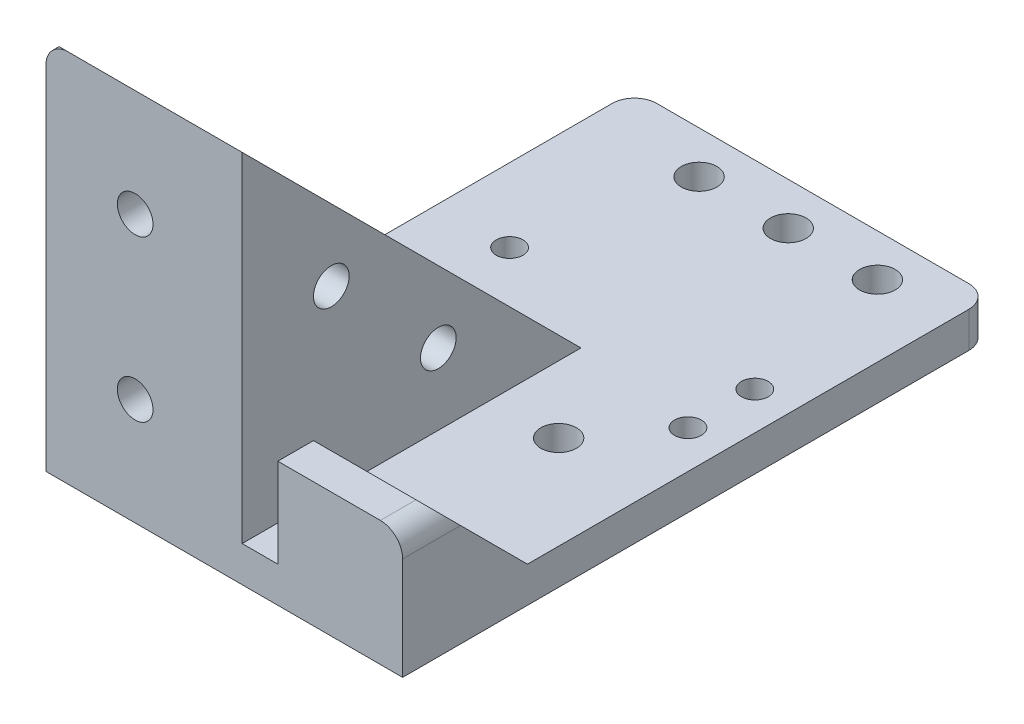
ISO-10303-21;
HEADER;
FILE_DESCRIPTION(('STEP AP214'),'2;1');
FILE_NAME('part.step','',(''),(''),'','','');
FILE_SCHEMA(('AUTOMOTIVE_DESIGN { 1 0 10303 214 1 1 1 1 }'));
ENDSEC;
DATA;
#1=APPLICATION_CONTEXT('core data for automotive mechanical design processes');
#2=APPLICATION_PROTOCOL_DEFINITION('international standard','automotive_design',2000,#1);
#3=PRODUCT_CONTEXT('',#1,'mechanical');
#4=PRODUCT('Part','Part','',(#3));
#5=PRODUCT_RELATED_PRODUCT_CATEGORY('part','',(#4));
#6=PRODUCT_DEFINITION_FORMATION('','',#4);
#7=PRODUCT_DEFINITION_CONTEXT('part definition',#1,'design');
#8=PRODUCT_DEFINITION('design','',#6,#7);
#9=PRODUCT_DEFINITION_SHAPE('','',#8);
#10=(LENGTH_UNIT() NAMED_UNIT(*) SI_UNIT(.MILLI.,.METRE.));
#11=(NAMED_UNIT(*) PLANE_ANGLE_UNIT() SI_UNIT($,.RADIAN.));
#12=(NAMED_UNIT(*) SI_UNIT($,.STERADIAN.) SOLID_ANGLE_UNIT());
#13=UNCERTAINTY_MEASURE_WITH_UNIT(LENGTH_MEASURE(1.E-05),#10,'distance_accuracy_value','');
#14=(GEOMETRIC_REPRESENTATION_CONTEXT(3) GLOBAL_UNCERTAINTY_ASSIGNED_CONTEXT((#13)) GLOBAL_UNIT_ASSIGNED_CONTEXT((#10,
#11,#12)) REPRESENTATION_CONTEXT('',''));
#15=CARTESIAN_POINT('',(0.,0.,0.));
#16=DIRECTION('',(0.,0.,1.));
#17=DIRECTION('',(1.,0.,0.));
#18=AXIS2_PLACEMENT_3D('',#15,#16,#17);
#19=CARTESIAN_POINT('',(-20.,4.,0.));
#20=DIRECTION('',(0.,0.,-1.));
#21=DIRECTION('',(-1.,0.,0.));
#22=AXIS2_PLACEMENT_3D('',#19,#20,#21);
#23=PLANE('',#22);
#24=CARTESIAN_POINT('',(-10.,12.,0.));
#25=DIRECTION('',(0.,0.,-1.));
#26=DIRECTION('',(-1.,0.,0.));
#27=AXIS2_PLACEMENT_3D('',#24,#25,#26);
#28=CIRCLE('',#27,2.);
#29=CARTESIAN_POINT('',(-12.,12.,0.));
#30=VERTEX_POINT('',#29);
#31=EDGE_CURVE('E357',#30,#30,#28,.T.);
#32=ORIENTED_EDGE('',*,*,#31,.T.);
#33=EDGE_LOOP('',(#32));
#34=FACE_BOUND('',#33,.T.);
#35=CARTESIAN_POINT('',(-10.,30.,0.));
#36=DIRECTION('',(0.,0.,-1.));
#37=DIRECTION('',(-1.,0.,0.));
#38=AXIS2_PLACEMENT_3D('',#35,#36,#37);
#39=CIRCLE('',#38,2.);
#40=CARTESIAN_POINT('',(-12.,30.,0.));
#41=VERTEX_POINT('',#40);
#42=EDGE_CURVE('E363',#41,#41,#39,.T.);
#43=ORIENTED_EDGE('',*,*,#42,.T.);
#44=EDGE_LOOP('',(#43));
#45=FACE_BOUND('',#44,.T.);
#46=DIRECTION('',(0.,-1.,0.));
#47=VECTOR('',#46,1.);
#48=CARTESIAN_POINT('',(20.,4.,0.));
#49=LINE('',#48,#47);
#50=CARTESIAN_POINT('',(20.,11.5,0.));
#51=VERTEX_POINT('',#50);
#52=CARTESIAN_POINT('',(20.,0.,0.));
#53=VERTEX_POINT('',#52);
#54=EDGE_CURVE('E177',#51,#53,#49,.T.);
#55=ORIENTED_EDGE('',*,*,#54,.F.);
#56=CARTESIAN_POINT('',(17.5,11.5,0.));
#57=DIRECTION('',(0.,0.,-1.));
#58=DIRECTION('',(-1.,0.,0.));
#59=AXIS2_PLACEMENT_3D('',#56,#57,#58);
#60=CIRCLE('',#59,2.5);
#61=CARTESIAN_POINT('',(17.5,14.,0.));
#62=VERTEX_POINT('',#61);
#63=EDGE_CURVE('E55',#51,#62,#60,.F.);
#64=ORIENTED_EDGE('',*,*,#63,.T.);
#65=DIRECTION('',(-1.,0.,0.));
#66=VECTOR('',#65,1.);
#67=CARTESIAN_POINT('',(6.,14.,0.));
#68=LINE('',#67,#66);
#69=CARTESIAN_POINT('',(6.,14.,0.));
#70=VERTEX_POINT('',#69);
#71=EDGE_CURVE('E192',#62,#70,#68,.T.);
#72=ORIENTED_EDGE('',*,*,#71,.T.);
#73=DIRECTION('',(0.,-1.,0.));
#74=VECTOR('',#73,1.);
#75=CARTESIAN_POINT('',(6.,4.,0.));
#76=LINE('',#75,#74);
#77=CARTESIAN_POINT('',(6.,4.,0.));
#78=VERTEX_POINT('',#77);
#79=EDGE_CURVE('E342',#70,#78,#76,.T.);
#80=ORIENTED_EDGE('',*,*,#79,.T.);
#81=DIRECTION('',(1.,0.,0.));
#82=VECTOR('',#81,1.);
#83=CARTESIAN_POINT('',(-20.,4.,0.));
#84=LINE('',#83,#82);
#85=CARTESIAN_POINT('',(2.,4.,0.));
#86=VERTEX_POINT('',#85);
#87=EDGE_CURVE('E181',#86,#78,#84,.T.);
#88=ORIENTED_EDGE('',*,*,#87,.F.);
#89=DIRECTION('',(0.,-1.,0.));
#90=VECTOR('',#89,1.);
#91=CARTESIAN_POINT('',(2.,4.,0.));
#92=LINE('',#91,#90);
#93=CARTESIAN_POINT('',(2.,42.,0.));
#94=VERTEX_POINT('',#93);
#95=EDGE_CURVE('E327',#94,#86,#92,.T.);
#96=ORIENTED_EDGE('',*,*,#95,.F.);
#97=DIRECTION('',(1.,0.,0.));
#98=VECTOR('',#97,1.);
#99=CARTESIAN_POINT('',(-25.6568542494923,42.,0.));
#100=LINE('',#99,#98);
#101=CARTESIAN_POINT('',(-17.5930467247093,42.,0.));
#102=VERTEX_POINT('',#101);
#103=EDGE_CURVE('E170',#102,#94,#100,.T.);
#104=ORIENTED_EDGE('',*,*,#103,.F.);
#105=CARTESIAN_POINT('',(-17.5008468049677,39.5017007435458,0.));
#106=DIRECTION('',(0.,0.,1.));
#107=DIRECTION('',(1.,0.,0.));
#108=AXIS2_PLACEMENT_3D('',#105,#106,#107);
#109=CIRCLE('',#108,2.5);
#110=CARTESIAN_POINT('',(-20.,39.5667646180047,0.));
#111=VERTEX_POINT('',#110);
#112=EDGE_CURVE('E155',#111,#102,#109,.F.);
#113=ORIENTED_EDGE('',*,*,#112,.F.);
#114=DIRECTION('',(0.,-1.,0.));
#115=VECTOR('',#114,1.);
#116=CARTESIAN_POINT('',(-20.,4.,0.));
#117=LINE('',#116,#115);
#118=CARTESIAN_POINT('',(-20.,0.,0.));
#119=VERTEX_POINT('',#118);
#120=EDGE_CURVE('E167',#111,#119,#117,.T.);
#121=ORIENTED_EDGE('',*,*,#120,.T.);
#122=DIRECTION('',(1.,0.,0.));
#123=VECTOR('',#122,1.);
#124=CARTESIAN_POINT('',(-20.,0.,0.));
#125=LINE('',#124,#123);
#126=EDGE_CURVE('E241',#119,#53,#125,.T.);
#127=ORIENTED_EDGE('',*,*,#126,.T.);
#128=EDGE_LOOP('',(#55,#64,#72,#80,#88,#96,#104,#113,#121,#127));
#129=FACE_BOUND('',#128,.T.);
#130=ADVANCED_FACE('F33',(#34,#45,#129),#23,.F.);
#131=CARTESIAN_POINT('',(0.,0.,-4.));
#132=DIRECTION('',(0.,0.,1.));
#133=DIRECTION('',(1.,0.,0.));
#134=AXIS2_PLACEMENT_3D('',#131,#132,#133);
#135=PLANE('',#134);
#136=DIRECTION('',(0.,-1.,0.));
#137=VECTOR('',#136,1.);
#138=CARTESIAN_POINT('',(16.,14.,-4.));
#139=LINE('',#138,#137);
#140=CARTESIAN_POINT('',(16.,14.,-4.));
#141=VERTEX_POINT('',#140);
#142=CARTESIAN_POINT('',(16.,4.,-4.));
#143=VERTEX_POINT('',#142);
#144=EDGE_CURVE('E379',#141,#143,#139,.T.);
#145=ORIENTED_EDGE('',*,*,#144,.T.);
#146=DIRECTION('',(1.,0.,0.));
#147=VECTOR('',#146,1.);
#148=CARTESIAN_POINT('',(6.,4.,-4.));
#149=LINE('',#148,#147);
#150=CARTESIAN_POINT('',(6.,4.,-4.));
#151=VERTEX_POINT('',#150);
#152=EDGE_CURVE('E345',#151,#143,#149,.T.);
#153=ORIENTED_EDGE('',*,*,#152,.F.);
#154=DIRECTION('',(0.,-1.,0.));
#155=VECTOR('',#154,1.);
#156=CARTESIAN_POINT('',(6.,4.,-4.));
#157=LINE('',#156,#155);
#158=CARTESIAN_POINT('',(6.,14.,-4.));
#159=VERTEX_POINT('',#158);
#160=EDGE_CURVE('E339',#159,#151,#157,.T.);
#161=ORIENTED_EDGE('',*,*,#160,.F.);
#162=DIRECTION('',(-1.,0.,0.));
#163=VECTOR('',#162,1.);
#164=CARTESIAN_POINT('',(6.,14.,-4.));
#165=LINE('',#164,#163);
#166=EDGE_CURVE('E351',#141,#159,#165,.T.);
#167=ORIENTED_EDGE('',*,*,#166,.F.);
#168=EDGE_LOOP('',(#145,#153,#161,#167));
#169=FACE_BOUND('',#168,.T.);
#170=ADVANCED_FACE('F429',(#169),#135,.F.);
#171=CARTESIAN_POINT('',(0.,4.,0.));
#172=DIRECTION('',(0.,1.,0.));
#173=DIRECTION('',(0.,0.,1.));
#174=AXIS2_PLACEMENT_3D('',#171,#172,#173);
#175=PLANE('',#174);
#176=DIRECTION('',(-1.,0.,0.));
#177=VECTOR('',#176,1.);
#178=CARTESIAN_POINT('',(-20.,4.,-66.));
#179=LINE('',#178,#177);
#180=CARTESIAN_POINT('',(17.5,4.,-66.));
#181=VERTEX_POINT('',#180);
#182=CARTESIAN_POINT('',(-17.5,4.,-66.));
#183=VERTEX_POINT('',#182);
#184=EDGE_CURVE('E245',#181,#183,#179,.T.);
#185=ORIENTED_EDGE('',*,*,#184,.T.);
#186=CARTESIAN_POINT('',(-17.5,4.,-63.5));
#187=DIRECTION('',(0.,1.,0.));
#188=DIRECTION('',(0.,0.,1.));
#189=AXIS2_PLACEMENT_3D('',#186,#187,#188);
#190=CIRCLE('',#189,2.5);
#191=CARTESIAN_POINT('',(-20.,4.,-63.5));
#192=VERTEX_POINT('',#191);
#193=EDGE_CURVE('E224',#183,#192,#190,.T.);
#194=ORIENTED_EDGE('',*,*,#193,.T.);
#195=DIRECTION('',(0.,0.,1.));
#196=VECTOR('',#195,1.);
#197=CARTESIAN_POINT('',(-20.,4.,-66.));
#198=LINE('',#197,#196);
#199=CARTESIAN_POINT('',(-20.,4.,-38.0000000000004));
#200=VERTEX_POINT('',#199);
#201=EDGE_CURVE('E256',#192,#200,#198,.T.);
#202=ORIENTED_EDGE('',*,*,#201,.T.);
#203=DIRECTION('',(-1.,0.,0.));
#204=VECTOR('',#203,1.);
#205=CARTESIAN_POINT('',(-16.,4.,-38.0000000000004));
#206=LINE('',#205,#204);
#207=CARTESIAN_POINT('',(-16.,4.,-38.0000000000004));
#208=VERTEX_POINT('',#207);
#209=EDGE_CURVE('E380',#208,#200,#206,.T.);
#210=ORIENTED_EDGE('',*,*,#209,.F.);
#211=DIRECTION('',(0.,0.,1.));
#212=VECTOR('',#211,1.);
#213=CARTESIAN_POINT('',(-16.,4.,-38.0000000000004));
#214=LINE('',#213,#212);
#215=CARTESIAN_POINT('',(-16.,4.,-4.));
#216=VERTEX_POINT('',#215);
#217=EDGE_CURVE('E390',#208,#216,#214,.T.);
#218=ORIENTED_EDGE('',*,*,#217,.T.);
#219=DIRECTION('',(1.,0.,0.));
#220=VECTOR('',#219,1.);
#221=CARTESIAN_POINT('',(-20.,4.,-4.));
#222=LINE('',#221,#220);
#223=CARTESIAN_POINT('',(-2.,4.,-4.));
#224=VERTEX_POINT('',#223);
#225=EDGE_CURVE('E196',#216,#224,#222,.T.);
#226=ORIENTED_EDGE('',*,*,#225,.T.);
#227=DIRECTION('',(0.,0.,-1.));
#228=VECTOR('',#227,1.);
#229=CARTESIAN_POINT('',(-2.,4.,-38.0000000000004));
#230=LINE('',#229,#228);
#231=CARTESIAN_POINT('',(-2.,4.,-38.0000000000004));
#232=VERTEX_POINT('',#231);
#233=EDGE_CURVE('E209',#224,#232,#230,.T.);
#234=ORIENTED_EDGE('',*,*,#233,.T.);
#235=DIRECTION('',(1.,0.,0.));
#236=VECTOR('',#235,1.);
#237=CARTESIAN_POINT('',(-2.,4.,-38.0000000000004));
#238=LINE('',#237,#236);
#239=CARTESIAN_POINT('',(2.,4.,-38.0000000000004));
#240=VERTEX_POINT('',#239);
#241=EDGE_CURVE('E208',#232,#240,#238,.T.);
#242=ORIENTED_EDGE('',*,*,#241,.T.);
#243=DIRECTION('',(0.,0.,-1.));
#244=VECTOR('',#243,1.);
#245=CARTESIAN_POINT('',(2.,4.,-38.0000000000004));
#246=LINE('',#245,#244);
#247=EDGE_CURVE('E332',#86,#240,#246,.T.);
#248=ORIENTED_EDGE('',*,*,#247,.F.);
#249=ORIENTED_EDGE('',*,*,#87,.T.);
#250=DIRECTION('',(0.,0.,1.));
#251=VECTOR('',#250,1.);
#252=CARTESIAN_POINT('',(6.,4.,-4.));
#253=LINE('',#252,#251);
#254=EDGE_CURVE('E202',#151,#78,#253,.T.);
#255=ORIENTED_EDGE('',*,*,#254,.F.);
#256=ORIENTED_EDGE('',*,*,#152,.T.);
#257=DIRECTION('',(0.,0.,-1.));
#258=VECTOR('',#257,1.);
#259=CARTESIAN_POINT('',(16.,4.,-4.));
#260=LINE('',#259,#258);
#261=CARTESIAN_POINT('',(16.,4.,-14.));
#262=VERTEX_POINT('',#261);
#263=EDGE_CURVE('E383',#143,#262,#260,.T.);
#264=ORIENTED_EDGE('',*,*,#263,.T.);
#265=DIRECTION('',(1.,0.,0.));
#266=VECTOR('',#265,1.);
#267=CARTESIAN_POINT('',(16.,4.,-14.));
#268=LINE('',#267,#266);
#269=CARTESIAN_POINT('',(20.,4.,-14.));
#270=VERTEX_POINT('',#269);
#271=EDGE_CURVE('E374',#262,#270,#268,.T.);
#272=ORIENTED_EDGE('',*,*,#271,.T.);
#273=DIRECTION('',(0.,0.,-1.));
#274=VECTOR('',#273,1.);
#275=CARTESIAN_POINT('',(20.,4.,-6.));
#276=LINE('',#275,#274);
#277=CARTESIAN_POINT('',(20.,4.,-63.5));
#278=VERTEX_POINT('',#277);
#279=EDGE_CURVE('E243',#270,#278,#276,.T.);
#280=ORIENTED_EDGE('',*,*,#279,.T.);
#281=CARTESIAN_POINT('',(17.5,4.,-63.5));
#282=DIRECTION('',(0.,1.,0.));
#283=DIRECTION('',(0.,0.,1.));
#284=AXIS2_PLACEMENT_3D('',#281,#282,#283);
#285=CIRCLE('',#284,2.5);
#286=EDGE_CURVE('E222',#278,#181,#285,.T.);
#287=ORIENTED_EDGE('',*,*,#286,.T.);
#288=EDGE_LOOP('',(#185,#194,#202,#210,#218,#226,#234,#242,#248,#249,#255,#256,#264,#272,#280,#287));
#289=FACE_BOUND('',#288,.T.);
#290=CARTESIAN_POINT('',(-11.7538718197397,4.,-36.25));
#291=DIRECTION('',(0.,1.,0.));
#292=DIRECTION('',(0.,0.,1.));
#293=AXIS2_PLACEMENT_3D('',#290,#291,#292);
#294=CIRCLE('',#293,1.5);
#295=CARTESIAN_POINT('',(-11.7538718197397,4.,-34.75));
#296=VERTEX_POINT('',#295);
#297=EDGE_CURVE('E266',#296,#296,#294,.T.);
#298=ORIENTED_EDGE('',*,*,#297,.F.);
#299=EDGE_LOOP('',(#298));
#300=FACE_BOUND('',#299,.T.);
#301=CARTESIAN_POINT('',(-11.7538718197397,4.,-43.75));
#302=DIRECTION('',(0.,1.,0.));
#303=DIRECTION('',(0.,0.,1.));
#304=AXIS2_PLACEMENT_3D('',#301,#302,#303);
#305=CIRCLE('',#304,1.5);
#306=CARTESIAN_POINT('',(-11.7538718197397,4.,-42.25));
#307=VERTEX_POINT('',#306);
#308=EDGE_CURVE('E272',#307,#307,#305,.T.);
#309=ORIENTED_EDGE('',*,*,#308,.F.);
#310=EDGE_LOOP('',(#309));
#311=FACE_BOUND('',#310,.T.);
#312=CARTESIAN_POINT('',(1.99612818026033,4.,-61.25));
#313=DIRECTION('',(0.,1.,0.));
#314=DIRECTION('',(0.,0.,1.));
#315=AXIS2_PLACEMENT_3D('',#312,#313,#314);
#316=CIRCLE('',#315,2.);
#317=CARTESIAN_POINT('',(1.99612818026033,4.,-59.25));
#318=VERTEX_POINT('',#317);
#319=EDGE_CURVE('E298',#318,#318,#316,.T.);
#320=ORIENTED_EDGE('',*,*,#319,.F.);
#321=EDGE_LOOP('',(#320));
#322=FACE_BOUND('',#321,.T.);
#323=CARTESIAN_POINT('',(11.9961281802603,4.,-61.25));
#324=DIRECTION('',(0.,1.,0.));
#325=DIRECTION('',(0.,0.,1.));
#326=AXIS2_PLACEMENT_3D('',#323,#324,#325);
#327=CIRCLE('',#326,2.);
#328=CARTESIAN_POINT('',(11.9961281802603,4.,-59.25));
#329=VERTEX_POINT('',#328);
#330=EDGE_CURVE('E292',#329,#329,#327,.T.);
#331=ORIENTED_EDGE('',*,*,#330,.F.);
#332=EDGE_LOOP('',(#331));
#333=FACE_BOUND('',#332,.T.);
#334=CARTESIAN_POINT('',(-5.50387181973967,4.,-7.99999999999999));
#335=DIRECTION('',(0.,1.,0.));
#336=DIRECTION('',(0.,0.,1.));
#337=AXIS2_PLACEMENT_3D('',#334,#335,#336);
#338=CIRCLE('',#337,2.);
#339=CARTESIAN_POINT('',(-5.50387181973967,4.,-5.99999999999999));
#340=VERTEX_POINT('',#339);
#341=EDGE_CURVE('E286',#340,#340,#338,.T.);
#342=ORIENTED_EDGE('',*,*,#341,.F.);
#343=EDGE_LOOP('',(#342));
#344=FACE_BOUND('',#343,.T.);
#345=CARTESIAN_POINT('',(-5.50387181973967,4.,-28.));
#346=DIRECTION('',(0.,1.,0.));
#347=DIRECTION('',(0.,0.,1.));
#348=AXIS2_PLACEMENT_3D('',#345,#346,#347);
#349=CIRCLE('',#348,2.);
#350=CARTESIAN_POINT('',(-5.50387181973967,4.,-26.));
#351=VERTEX_POINT('',#350);
#352=EDGE_CURVE('E279',#351,#351,#349,.T.);
#353=ORIENTED_EDGE('',*,*,#352,.F.);
#354=EDGE_LOOP('',(#353));
#355=FACE_BOUND('',#354,.T.);
#356=CARTESIAN_POINT('',(9.49612818026033,4.,-28.));
#357=DIRECTION('',(0.,1.,0.));
#358=DIRECTION('',(0.,0.,1.));
#359=AXIS2_PLACEMENT_3D('',#356,#357,#358);
#360=CIRCLE('',#359,2.);
#361=CARTESIAN_POINT('',(9.49612818026033,4.,-26.));
#362=VERTEX_POINT('',#361);
#363=EDGE_CURVE('E320',#362,#362,#360,.T.);
#364=ORIENTED_EDGE('',*,*,#363,.F.);
#365=EDGE_LOOP('',(#364));
#366=FACE_BOUND('',#365,.T.);
#367=CARTESIAN_POINT('',(9.49612818026033,4.,-7.99999999999999));
#368=DIRECTION('',(0.,1.,0.));
#369=DIRECTION('',(0.,0.,1.));
#370=AXIS2_PLACEMENT_3D('',#367,#368,#369);
#371=CIRCLE('',#370,2.);
#372=CARTESIAN_POINT('',(9.49612818026033,4.,-5.99999999999999));
#373=VERTEX_POINT('',#372);
#374=EDGE_CURVE('E314',#373,#373,#371,.T.);
#375=ORIENTED_EDGE('',*,*,#374,.F.);
#376=EDGE_LOOP('',(#375));
#377=FACE_BOUND('',#376,.T.);
#378=CARTESIAN_POINT('',(15.7461281802603,4.,-36.25));
#379=DIRECTION('',(0.,1.,0.));
#380=DIRECTION('',(0.,0.,1.));
#381=AXIS2_PLACEMENT_3D('',#378,#379,#380);
#382=CIRCLE('',#381,1.5);
#383=CARTESIAN_POINT('',(15.7461281802603,4.,-34.75));
#384=VERTEX_POINT('',#383);
#385=EDGE_CURVE('E308',#384,#384,#382,.T.);
#386=ORIENTED_EDGE('',*,*,#385,.F.);
#387=EDGE_LOOP('',(#386));
#388=FACE_BOUND('',#387,.T.);
#389=CARTESIAN_POINT('',(15.7461281802603,4.,-43.75));
#390=DIRECTION('',(0.,1.,0.));
#391=DIRECTION('',(0.,0.,1.));
#392=AXIS2_PLACEMENT_3D('',#389,#390,#391);
#393=CIRCLE('',#392,1.5);
#394=CARTESIAN_POINT('',(15.7461281802603,4.,-42.25));
#395=VERTEX_POINT('',#394);
#396=EDGE_CURVE('E278',#395,#395,#393,.T.);
#397=ORIENTED_EDGE('',*,*,#396,.F.);
#398=EDGE_LOOP('',(#397));
#399=FACE_BOUND('',#398,.T.);
#400=CARTESIAN_POINT('',(-8.00387181973967,4.,-61.25));
#401=DIRECTION('',(0.,1.,0.));
#402=DIRECTION('',(0.,0.,1.));
#403=AXIS2_PLACEMENT_3D('',#400,#401,#402);
#404=CIRCLE('',#403,2.);
#405=CARTESIAN_POINT('',(-8.00387181973967,4.,-59.25));
#406=VERTEX_POINT('',#405);
#407=EDGE_CURVE('E260',#406,#406,#404,.T.);
#408=ORIENTED_EDGE('',*,*,#407,.F.);
#409=EDGE_LOOP('',(#408));
#410=FACE_BOUND('',#409,.T.);
#411=ADVANCED_FACE('F411',(#289,#300,#311,#322,#333,#344,#355,#366,#377,#388,#399,#410),#175,.T.);
#412=CARTESIAN_POINT('',(-2.,0.,0.));
#413=DIRECTION('',(-1.,0.,0.));
#414=DIRECTION('',(0.,0.,1.));
#415=AXIS2_PLACEMENT_3D('',#412,#413,#414);
#416=PLANE('',#415);
#417=CARTESIAN_POINT('',(-2.,24.,-10.));
#418=DIRECTION('',(-1.,0.,0.));
#419=DIRECTION('',(0.,0.,1.));
#420=AXIS2_PLACEMENT_3D('',#417,#418,#419);
#421=CIRCLE('',#420,2.);
#422=CARTESIAN_POINT('',(-2.,24.,-8.));
#423=VERTEX_POINT('',#422);
#424=EDGE_CURVE('E189',#423,#423,#421,.T.);
#425=ORIENTED_EDGE('',*,*,#424,.F.);
#426=EDGE_LOOP('',(#425));
#427=FACE_BOUND('',#426,.T.);
#428=CARTESIAN_POINT('',(-2.,12.,-22.));
#429=DIRECTION('',(-1.,0.,0.));
#430=DIRECTION('',(0.,0.,1.));
#431=AXIS2_PLACEMENT_3D('',#428,#429,#430);
#432=CIRCLE('',#431,2.);
#433=CARTESIAN_POINT('',(-2.,12.,-20.));
#434=VERTEX_POINT('',#433);
#435=EDGE_CURVE('E354',#434,#434,#432,.T.);
#436=ORIENTED_EDGE('',*,*,#435,.F.);
#437=EDGE_LOOP('',(#436));
#438=FACE_BOUND('',#437,.T.);
#439=ORIENTED_EDGE('',*,*,#233,.F.);
#440=DIRECTION('',(0.,1.,0.));
#441=VECTOR('',#440,1.);
#442=CARTESIAN_POINT('',(-2.,4.,-4.));
#443=LINE('',#442,#441);
#444=CARTESIAN_POINT('',(-2.,38.,-4.));
#445=VERTEX_POINT('',#444);
#446=EDGE_CURVE('E197',#224,#445,#443,.T.);
#447=ORIENTED_EDGE('',*,*,#446,.T.);
#448=DIRECTION('',(0.,0.707106781186543,0.707106781186552));
#449=VECTOR('',#448,1.);
#450=CARTESIAN_POINT('',(-2.,38.,-4.));
#451=LINE('',#450,#449);
#452=EDGE_CURVE('E205',#232,#445,#451,.T.);
#453=ORIENTED_EDGE('',*,*,#452,.F.);
#454=EDGE_LOOP('',(#439,#447,#453));
#455=FACE_BOUND('',#454,.T.);
#456=ADVANCED_FACE('F409',(#427,#438,#455),#416,.T.);
#457=CARTESIAN_POINT('',(20.,4.,-66.));
#458=DIRECTION('',(-1.,0.,0.));
#459=DIRECTION('',(0.,0.,1.));
#460=AXIS2_PLACEMENT_3D('',#457,#458,#459);
#461=PLANE('',#460);
#462=DIRECTION('',(0.,0.707106781186549,0.707106781186546));
#463=VECTOR('',#462,1.);
#464=CARTESIAN_POINT('',(20.,14.,-4.));
#465=LINE('',#464,#463);
#466=CARTESIAN_POINT('',(20.,11.5,-6.49999999999999));
#467=VERTEX_POINT('',#466);
#468=EDGE_CURVE('E238',#270,#467,#465,.T.);
#469=ORIENTED_EDGE('',*,*,#468,.T.);
#470=DIRECTION('',(0.,0.,1.));
#471=VECTOR('',#470,1.);
#472=CARTESIAN_POINT('',(20.,11.5,0.));
#473=LINE('',#472,#471);
#474=EDGE_CURVE('E228',#467,#51,#473,.T.);
#475=ORIENTED_EDGE('',*,*,#474,.T.);
#476=ORIENTED_EDGE('',*,*,#54,.T.);
#477=DIRECTION('',(0.,0.,-1.));
#478=VECTOR('',#477,1.);
#479=CARTESIAN_POINT('',(20.,0.,-66.));
#480=LINE('',#479,#478);
#481=CARTESIAN_POINT('',(20.,0.,-63.5));
#482=VERTEX_POINT('',#481);
#483=EDGE_CURVE('E252',#53,#482,#480,.T.);
#484=ORIENTED_EDGE('',*,*,#483,.T.);
#485=DIRECTION('',(0.,-1.,0.));
#486=VECTOR('',#485,1.);
#487=CARTESIAN_POINT('',(20.,4.,-63.5));
#488=LINE('',#487,#486);
#489=EDGE_CURVE('E226',#482,#278,#488,.F.);
#490=ORIENTED_EDGE('',*,*,#489,.T.);
#491=ORIENTED_EDGE('',*,*,#279,.F.);
#492=EDGE_LOOP('',(#469,#475,#476,#484,#490,#491));
#493=FACE_BOUND('',#492,.T.);
#494=ADVANCED_FACE('F234',(#493),#461,.F.);
#495=CARTESIAN_POINT('',(-20.,4.,-66.));
#496=DIRECTION('',(0.,0.,1.));
#497=DIRECTION('',(1.,0.,0.));
#498=AXIS2_PLACEMENT_3D('',#495,#496,#497);
#499=PLANE('',#498);
#500=DIRECTION('',(-1.,0.,0.));
#501=VECTOR('',#500,1.);
#502=CARTESIAN_POINT('',(-20.,0.,-66.));
#503=LINE('',#502,#501);
#504=CARTESIAN_POINT('',(17.5,0.,-66.));
#505=VERTEX_POINT('',#504);
#506=CARTESIAN_POINT('',(-17.5,0.,-66.));
#507=VERTEX_POINT('',#506);
#508=EDGE_CURVE('E247',#505,#507,#503,.T.);
#509=ORIENTED_EDGE('',*,*,#508,.T.);
#510=DIRECTION('',(0.,-1.,0.));
#511=VECTOR('',#510,1.);
#512=CARTESIAN_POINT('',(-17.5,4.,-66.));
#513=LINE('',#512,#511);
#514=EDGE_CURVE('E220',#507,#183,#513,.F.);
#515=ORIENTED_EDGE('',*,*,#514,.T.);
#516=ORIENTED_EDGE('',*,*,#184,.F.);
#517=DIRECTION('',(0.,-1.,0.));
#518=VECTOR('',#517,1.);
#519=CARTESIAN_POINT('',(17.5,4.,-66.));
#520=LINE('',#519,#518);
#521=EDGE_CURVE('E217',#181,#505,#520,.T.);
#522=ORIENTED_EDGE('',*,*,#521,.T.);
#523=EDGE_LOOP('',(#509,#515,#516,#522));
#524=FACE_BOUND('',#523,.T.);
#525=ADVANCED_FACE('F444',(#524),#499,.F.);
#526=CARTESIAN_POINT('',(-20.,4.,-5.99999999999999));
#527=DIRECTION('',(1.,0.,0.));
#528=DIRECTION('',(0.,0.,-1.));
#529=AXIS2_PLACEMENT_3D('',#526,#527,#528);
#530=PLANE('',#529);
#531=ORIENTED_EDGE('',*,*,#201,.F.);
#532=DIRECTION('',(0.,-1.,0.));
#533=VECTOR('',#532,1.);
#534=CARTESIAN_POINT('',(-20.,4.,-63.5));
#535=LINE('',#534,#533);
#536=CARTESIAN_POINT('',(-20.,0.,-63.5));
#537=VERTEX_POINT('',#536);
#538=EDGE_CURVE('E179',#192,#537,#535,.T.);
#539=ORIENTED_EDGE('',*,*,#538,.T.);
#540=DIRECTION('',(0.,0.,1.));
#541=VECTOR('',#540,1.);
#542=CARTESIAN_POINT('',(-20.,0.,-5.99999999999999));
#543=LINE('',#542,#541);
#544=EDGE_CURVE('E176',#537,#119,#543,.T.);
#545=ORIENTED_EDGE('',*,*,#544,.T.);
#546=ORIENTED_EDGE('',*,*,#120,.F.);
#547=DIRECTION('',(0.,0.,1.));
#548=VECTOR('',#547,1.);
#549=CARTESIAN_POINT('',(-20.,39.5667646180047,-4.));
#550=LINE('',#549,#548);
#551=CARTESIAN_POINT('',(-20.,39.5667646180047,-2.43323538199525));
#552=VERTEX_POINT('',#551);
#553=EDGE_CURVE('E152',#552,#111,#550,.T.);
#554=ORIENTED_EDGE('',*,*,#553,.F.);
#555=DIRECTION('',(0.,-0.707106781186543,-0.707106781186552));
#556=VECTOR('',#555,1.);
#557=CARTESIAN_POINT('',(-20.,38.,-4.));
#558=LINE('',#557,#556);
#559=EDGE_CURVE('E364',#552,#200,#558,.T.);
#560=ORIENTED_EDGE('',*,*,#559,.T.);
#561=EDGE_LOOP('',(#531,#539,#545,#546,#554,#560));
#562=FACE_BOUND('',#561,.T.);
#563=ADVANCED_FACE('F173',(#562),#530,.F.);
#564=CARTESIAN_POINT('',(0.,0.,0.));
#565=DIRECTION('',(0.,1.,0.));
#566=DIRECTION('',(0.,0.,1.));
#567=AXIS2_PLACEMENT_3D('',#564,#565,#566);
#568=PLANE('',#567);
#569=CARTESIAN_POINT('',(-11.7538718197397,0.,-36.25));
#570=DIRECTION('',(0.,1.,0.));
#571=DIRECTION('',(0.,0.,1.));
#572=AXIS2_PLACEMENT_3D('',#569,#570,#571);
#573=CIRCLE('',#572,1.5);
#574=CARTESIAN_POINT('',(-11.7538718197397,0.,-34.75));
#575=VERTEX_POINT('',#574);
#576=EDGE_CURVE('E269',#575,#575,#573,.T.);
#577=ORIENTED_EDGE('',*,*,#576,.T.);
#578=EDGE_LOOP('',(#577));
#579=FACE_BOUND('',#578,.T.);
#580=CARTESIAN_POINT('',(-11.7538718197397,0.,-43.75));
#581=DIRECTION('',(0.,1.,0.));
#582=DIRECTION('',(0.,0.,1.));
#583=AXIS2_PLACEMENT_3D('',#580,#581,#582);
#584=CIRCLE('',#583,1.5);
#585=CARTESIAN_POINT('',(-11.7538718197397,0.,-42.25));
#586=VERTEX_POINT('',#585);
#587=EDGE_CURVE('E275',#586,#586,#584,.T.);
#588=ORIENTED_EDGE('',*,*,#587,.T.);
#589=EDGE_LOOP('',(#588));
#590=FACE_BOUND('',#589,.T.);
#591=CARTESIAN_POINT('',(1.99612818026033,0.,-61.25));
#592=DIRECTION('',(0.,1.,0.));
#593=DIRECTION('',(0.,0.,1.));
#594=AXIS2_PLACEMENT_3D('',#591,#592,#593);
#595=CIRCLE('',#594,2.);
#596=CARTESIAN_POINT('',(1.99612818026033,0.,-59.25));
#597=VERTEX_POINT('',#596);
#598=EDGE_CURVE('E263',#597,#597,#595,.T.);
#599=ORIENTED_EDGE('',*,*,#598,.T.);
#600=EDGE_LOOP('',(#599));
#601=FACE_BOUND('',#600,.T.);
#602=CARTESIAN_POINT('',(11.9961281802603,0.,-61.25));
#603=DIRECTION('',(0.,1.,0.));
#604=DIRECTION('',(0.,0.,1.));
#605=AXIS2_PLACEMENT_3D('',#602,#603,#604);
#606=CIRCLE('',#605,2.);
#607=CARTESIAN_POINT('',(11.9961281802603,0.,-59.25));
#608=VERTEX_POINT('',#607);
#609=EDGE_CURVE('E295',#608,#608,#606,.T.);
#610=ORIENTED_EDGE('',*,*,#609,.T.);
#611=EDGE_LOOP('',(#610));
#612=FACE_BOUND('',#611,.T.);
#613=CARTESIAN_POINT('',(-5.50387181973967,0.,-7.99999999999999));
#614=DIRECTION('',(0.,1.,0.));
#615=DIRECTION('',(0.,0.,1.));
#616=AXIS2_PLACEMENT_3D('',#613,#614,#615);
#617=CIRCLE('',#616,2.);
#618=CARTESIAN_POINT('',(-5.50387181973967,0.,-5.99999999999999));
#619=VERTEX_POINT('',#618);
#620=EDGE_CURVE('E289',#619,#619,#617,.T.);
#621=ORIENTED_EDGE('',*,*,#620,.T.);
#622=EDGE_LOOP('',(#621));
#623=FACE_BOUND('',#622,.T.);
#624=CARTESIAN_POINT('',(-5.50387181973967,0.,-28.));
#625=DIRECTION('',(0.,1.,0.));
#626=DIRECTION('',(0.,0.,1.));
#627=AXIS2_PLACEMENT_3D('',#624,#625,#626);
#628=CIRCLE('',#627,2.);
#629=CARTESIAN_POINT('',(-5.50387181973967,0.,-26.));
#630=VERTEX_POINT('',#629);
#631=EDGE_CURVE('E282',#630,#630,#628,.T.);
#632=ORIENTED_EDGE('',*,*,#631,.T.);
#633=EDGE_LOOP('',(#632));
#634=FACE_BOUND('',#633,.T.);
#635=CARTESIAN_POINT('',(9.49612818026033,0.,-28.));
#636=DIRECTION('',(0.,1.,0.));
#637=DIRECTION('',(0.,0.,1.));
#638=AXIS2_PLACEMENT_3D('',#635,#636,#637);
#639=CIRCLE('',#638,2.);
#640=CARTESIAN_POINT('',(9.49612818026033,0.,-26.));
#641=VERTEX_POINT('',#640);
#642=EDGE_CURVE('E283',#641,#641,#639,.T.);
#643=ORIENTED_EDGE('',*,*,#642,.T.);
#644=EDGE_LOOP('',(#643));
#645=FACE_BOUND('',#644,.T.);
#646=CARTESIAN_POINT('',(9.49612818026033,0.,-7.99999999999999));
#647=DIRECTION('',(0.,1.,0.));
#648=DIRECTION('',(0.,0.,1.));
#649=AXIS2_PLACEMENT_3D('',#646,#647,#648);
#650=CIRCLE('',#649,2.);
#651=CARTESIAN_POINT('',(9.49612818026033,0.,-5.99999999999999));
#652=VERTEX_POINT('',#651);
#653=EDGE_CURVE('E317',#652,#652,#650,.T.);
#654=ORIENTED_EDGE('',*,*,#653,.T.);
#655=EDGE_LOOP('',(#654));
#656=FACE_BOUND('',#655,.T.);
#657=CARTESIAN_POINT('',(15.7461281802603,0.,-36.25));
#658=DIRECTION('',(0.,1.,0.));
#659=DIRECTION('',(0.,0.,1.));
#660=AXIS2_PLACEMENT_3D('',#657,#658,#659);
#661=CIRCLE('',#660,1.5);
#662=CARTESIAN_POINT('',(15.7461281802603,0.,-34.75));
#663=VERTEX_POINT('',#662);
#664=EDGE_CURVE('E311',#663,#663,#661,.T.);
#665=ORIENTED_EDGE('',*,*,#664,.T.);
#666=EDGE_LOOP('',(#665));
#667=FACE_BOUND('',#666,.T.);
#668=CARTESIAN_POINT('',(15.7461281802603,0.,-43.75));
#669=DIRECTION('',(0.,1.,0.));
#670=DIRECTION('',(0.,0.,1.));
#671=AXIS2_PLACEMENT_3D('',#668,#669,#670);
#672=CIRCLE('',#671,1.5);
#673=CARTESIAN_POINT('',(15.7461281802603,0.,-42.25));
#674=VERTEX_POINT('',#673);
#675=EDGE_CURVE('E305',#674,#674,#672,.T.);
#676=ORIENTED_EDGE('',*,*,#675,.T.);
#677=EDGE_LOOP('',(#676));
#678=FACE_BOUND('',#677,.T.);
#679=CARTESIAN_POINT('',(-8.00387181973967,0.,-61.25));
#680=DIRECTION('',(0.,1.,0.));
#681=DIRECTION('',(0.,0.,1.));
#682=AXIS2_PLACEMENT_3D('',#679,#680,#681);
#683=CIRCLE('',#682,2.);
#684=CARTESIAN_POINT('',(-8.00387181973967,0.,-59.25));
#685=VERTEX_POINT('',#684);
#686=EDGE_CURVE('E254',#685,#685,#683,.T.);
#687=ORIENTED_EDGE('',*,*,#686,.T.);
#688=EDGE_LOOP('',(#687));
#689=FACE_BOUND('',#688,.T.);
#690=ORIENTED_EDGE('',*,*,#544,.F.);
#691=CARTESIAN_POINT('',(-17.5,0.,-63.5));
#692=DIRECTION('',(0.,1.,0.));
#693=DIRECTION('',(0.,0.,1.));
#694=AXIS2_PLACEMENT_3D('',#691,#692,#693);
#695=CIRCLE('',#694,2.5);
#696=EDGE_CURVE('E215',#537,#507,#695,.F.);
#697=ORIENTED_EDGE('',*,*,#696,.T.);
#698=ORIENTED_EDGE('',*,*,#508,.F.);
#699=CARTESIAN_POINT('',(17.5,0.,-63.5));
#700=DIRECTION('',(0.,1.,0.));
#701=DIRECTION('',(0.,0.,1.));
#702=AXIS2_PLACEMENT_3D('',#699,#700,#701);
#703=CIRCLE('',#702,2.5);
#704=EDGE_CURVE('E213',#505,#482,#703,.F.);
#705=ORIENTED_EDGE('',*,*,#704,.T.);
#706=ORIENTED_EDGE('',*,*,#483,.F.);
#707=ORIENTED_EDGE('',*,*,#126,.F.);
#708=EDGE_LOOP('',(#690,#697,#698,#705,#706,#707));
#709=FACE_BOUND('',#708,.T.);
#710=ADVANCED_FACE('F440',(#579,#590,#601,#612,#623,#634,#645,#656,#667,#678,#689,#709),#568,.F.);
#711=CARTESIAN_POINT('',(-8.00387181973967,0.,-61.25));
#712=DIRECTION('',(0.,1.,0.));
#713=DIRECTION('',(0.,0.,1.));
#714=AXIS2_PLACEMENT_3D('',#711,#712,#713);
#715=CYLINDRICAL_SURFACE('',#714,2.);
#716=ORIENTED_EDGE('',*,*,#686,.F.);
#717=EDGE_LOOP('',(#716));
#718=FACE_BOUND('',#717,.T.);
#719=ORIENTED_EDGE('',*,*,#407,.T.);
#720=EDGE_LOOP('',(#719));
#721=FACE_BOUND('',#720,.T.);
#722=ADVANCED_FACE('F520',(#718,#721),#715,.F.);
#723=CARTESIAN_POINT('',(15.7461281802603,0.,-43.75));
#724=DIRECTION('',(0.,1.,0.));
#725=DIRECTION('',(0.,0.,1.));
#726=AXIS2_PLACEMENT_3D('',#723,#724,#725);
#727=CYLINDRICAL_SURFACE('',#726,1.5);
#728=ORIENTED_EDGE('',*,*,#675,.F.);
#729=EDGE_LOOP('',(#728));
#730=FACE_BOUND('',#729,.T.);
#731=ORIENTED_EDGE('',*,*,#396,.T.);
#732=EDGE_LOOP('',(#731));
#733=FACE_BOUND('',#732,.T.);
#734=ADVANCED_FACE('F516',(#730,#733),#727,.F.);
#735=CARTESIAN_POINT('',(15.7461281802603,0.,-36.25));
#736=DIRECTION('',(0.,1.,0.));
#737=DIRECTION('',(0.,0.,1.));
#738=AXIS2_PLACEMENT_3D('',#735,#736,#737);
#739=CYLINDRICAL_SURFACE('',#738,1.5);
#740=ORIENTED_EDGE('',*,*,#664,.F.);
#741=EDGE_LOOP('',(#740));
#742=FACE_BOUND('',#741,.T.);
#743=ORIENTED_EDGE('',*,*,#385,.T.);
#744=EDGE_LOOP('',(#743));
#745=FACE_BOUND('',#744,.T.);
#746=ADVANCED_FACE('F512',(#742,#745),#739,.F.);
#747=CARTESIAN_POINT('',(9.49612818026033,0.,-7.99999999999999));
#748=DIRECTION('',(0.,1.,0.));
#749=DIRECTION('',(0.,0.,1.));
#750=AXIS2_PLACEMENT_3D('',#747,#748,#749);
#751=CYLINDRICAL_SURFACE('',#750,2.);
#752=ORIENTED_EDGE('',*,*,#653,.F.);
#753=EDGE_LOOP('',(#752));
#754=FACE_BOUND('',#753,.T.);
#755=ORIENTED_EDGE('',*,*,#374,.T.);
#756=EDGE_LOOP('',(#755));
#757=FACE_BOUND('',#756,.T.);
#758=ADVANCED_FACE('F508',(#754,#757),#751,.F.);
#759=CARTESIAN_POINT('',(9.49612818026033,0.,-28.));
#760=DIRECTION('',(0.,1.,0.));
#761=DIRECTION('',(0.,0.,1.));
#762=AXIS2_PLACEMENT_3D('',#759,#760,#761);
#763=CYLINDRICAL_SURFACE('',#762,2.);
#764=ORIENTED_EDGE('',*,*,#642,.F.);
#765=EDGE_LOOP('',(#764));
#766=FACE_BOUND('',#765,.T.);
#767=ORIENTED_EDGE('',*,*,#363,.T.);
#768=EDGE_LOOP('',(#767));
#769=FACE_BOUND('',#768,.T.);
#770=ADVANCED_FACE('F504',(#766,#769),#763,.F.);
#771=CARTESIAN_POINT('',(-5.50387181973967,0.,-28.));
#772=DIRECTION('',(0.,1.,0.));
#773=DIRECTION('',(0.,0.,1.));
#774=AXIS2_PLACEMENT_3D('',#771,#772,#773);
#775=CYLINDRICAL_SURFACE('',#774,2.);
#776=ORIENTED_EDGE('',*,*,#631,.F.);
#777=EDGE_LOOP('',(#776));
#778=FACE_BOUND('',#777,.T.);
#779=ORIENTED_EDGE('',*,*,#352,.T.);
#780=EDGE_LOOP('',(#779));
#781=FACE_BOUND('',#780,.T.);
#782=ADVANCED_FACE('F507',(#778,#781),#775,.F.);
#783=CARTESIAN_POINT('',(-5.50387181973967,0.,-7.99999999999999));
#784=DIRECTION('',(0.,1.,0.));
#785=DIRECTION('',(0.,0.,1.));
#786=AXIS2_PLACEMENT_3D('',#783,#784,#785);
#787=CYLINDRICAL_SURFACE('',#786,2.);
#788=ORIENTED_EDGE('',*,*,#620,.F.);
#789=EDGE_LOOP('',(#788));
#790=FACE_BOUND('',#789,.T.);
#791=ORIENTED_EDGE('',*,*,#341,.T.);
#792=EDGE_LOOP('',(#791));
#793=FACE_BOUND('',#792,.T.);
#794=ADVANCED_FACE('F530',(#790,#793),#787,.F.);
#795=CARTESIAN_POINT('',(11.9961281802603,0.,-61.25));
#796=DIRECTION('',(0.,1.,0.));
#797=DIRECTION('',(0.,0.,1.));
#798=AXIS2_PLACEMENT_3D('',#795,#796,#797);
#799=CYLINDRICAL_SURFACE('',#798,2.);
#800=ORIENTED_EDGE('',*,*,#609,.F.);
#801=EDGE_LOOP('',(#800));
#802=FACE_BOUND('',#801,.T.);
#803=ORIENTED_EDGE('',*,*,#330,.T.);
#804=EDGE_LOOP('',(#803));
#805=FACE_BOUND('',#804,.T.);
#806=ADVANCED_FACE('F526',(#802,#805),#799,.F.);
#807=CARTESIAN_POINT('',(1.99612818026033,0.,-61.25));
#808=DIRECTION('',(0.,1.,0.));
#809=DIRECTION('',(0.,0.,1.));
#810=AXIS2_PLACEMENT_3D('',#807,#808,#809);
#811=CYLINDRICAL_SURFACE('',#810,2.);
#812=ORIENTED_EDGE('',*,*,#598,.F.);
#813=EDGE_LOOP('',(#812));
#814=FACE_BOUND('',#813,.T.);
#815=ORIENTED_EDGE('',*,*,#319,.T.);
#816=EDGE_LOOP('',(#815));
#817=FACE_BOUND('',#816,.T.);
#818=ADVANCED_FACE('F522',(#814,#817),#811,.F.);
#819=CARTESIAN_POINT('',(-11.7538718197397,0.,-43.75));
#820=DIRECTION('',(0.,1.,0.));
#821=DIRECTION('',(0.,0.,1.));
#822=AXIS2_PLACEMENT_3D('',#819,#820,#821);
#823=CYLINDRICAL_SURFACE('',#822,1.5);
#824=ORIENTED_EDGE('',*,*,#587,.F.);
#825=EDGE_LOOP('',(#824));
#826=FACE_BOUND('',#825,.T.);
#827=ORIENTED_EDGE('',*,*,#308,.T.);
#828=EDGE_LOOP('',(#827));
#829=FACE_BOUND('',#828,.T.);
#830=ADVANCED_FACE('F525',(#826,#829),#823,.F.);
#831=CARTESIAN_POINT('',(-11.7538718197397,0.,-36.25));
#832=DIRECTION('',(0.,1.,0.));
#833=DIRECTION('',(0.,0.,1.));
#834=AXIS2_PLACEMENT_3D('',#831,#832,#833);
#835=CYLINDRICAL_SURFACE('',#834,1.5);
#836=ORIENTED_EDGE('',*,*,#576,.F.);
#837=EDGE_LOOP('',(#836));
#838=FACE_BOUND('',#837,.T.);
#839=ORIENTED_EDGE('',*,*,#297,.T.);
#840=EDGE_LOOP('',(#839));
#841=FACE_BOUND('',#840,.T.);
#842=ADVANCED_FACE('F503',(#838,#841),#835,.F.);
#843=CARTESIAN_POINT('',(-2.,38.,-4.));
#844=DIRECTION('',(0.,0.707106781186552,-0.707106781186543));
#845=DIRECTION('',(0.,0.707106781186543,0.707106781186552));
#846=AXIS2_PLACEMENT_3D('',#843,#844,#845);
#847=PLANE('',#846);
#848=CARTESIAN_POINT('',(-17.5008468049677,39.5017007435458,-2.49829925645423));
#849=DIRECTION('',(0.,0.707106781186552,-0.707106781186543));
#850=DIRECTION('',(0.,0.707106781186543,0.707106781186552));
#851=AXIS2_PLACEMENT_3D('',#848,#849,#850);
#852=ELLIPSE('',#851,3.53553390593276,2.5);
#853=EDGE_CURVE('E157',#102,#552,#852,.F.);
#854=ORIENTED_EDGE('',*,*,#853,.F.);
#855=ORIENTED_EDGE('',*,*,#103,.T.);
#856=DIRECTION('',(0.,0.707106781186543,0.707106781186552));
#857=VECTOR('',#856,1.);
#858=CARTESIAN_POINT('',(2.,38.,-4.));
#859=LINE('',#858,#857);
#860=EDGE_CURVE('E329',#240,#94,#859,.T.);
#861=ORIENTED_EDGE('',*,*,#860,.F.);
#862=ORIENTED_EDGE('',*,*,#241,.F.);
#863=ORIENTED_EDGE('',*,*,#452,.T.);
#864=DIRECTION('',(-1.,0.,0.));
#865=VECTOR('',#864,1.);
#866=CARTESIAN_POINT('',(-2.,38.,-4.));
#867=LINE('',#866,#865);
#868=CARTESIAN_POINT('',(-16.,38.,-4.));
#869=VERTEX_POINT('',#868);
#870=EDGE_CURVE('E193',#445,#869,#867,.T.);
#871=ORIENTED_EDGE('',*,*,#870,.T.);
#872=DIRECTION('',(0.,-0.707106781186544,-0.707106781186551));
#873=VECTOR('',#872,1.);
#874=CARTESIAN_POINT('',(-16.,38.,-4.));
#875=LINE('',#874,#873);
#876=EDGE_CURVE('E393',#869,#208,#875,.T.);
#877=ORIENTED_EDGE('',*,*,#876,.T.);
#878=ORIENTED_EDGE('',*,*,#209,.T.);
#879=ORIENTED_EDGE('',*,*,#559,.F.);
#880=EDGE_LOOP('',(#854,#855,#861,#862,#863,#871,#877,#878,#879));
#881=FACE_BOUND('',#880,.T.);
#882=ADVANCED_FACE('F403',(#881),#847,.T.);
#883=CARTESIAN_POINT('',(2.,0.,0.));
#884=DIRECTION('',(-1.,0.,0.));
#885=DIRECTION('',(0.,0.,1.));
#886=AXIS2_PLACEMENT_3D('',#883,#884,#885);
#887=PLANE('',#886);
#888=CARTESIAN_POINT('',(2.,24.,-10.));
#889=DIRECTION('',(-1.,0.,0.));
#890=DIRECTION('',(0.,0.,1.));
#891=AXIS2_PLACEMENT_3D('',#888,#889,#890);
#892=CIRCLE('',#891,2.);
#893=CARTESIAN_POINT('',(2.,24.,-8.));
#894=VERTEX_POINT('',#893);
#895=EDGE_CURVE('E188',#894,#894,#892,.T.);
#896=ORIENTED_EDGE('',*,*,#895,.T.);
#897=EDGE_LOOP('',(#896));
#898=FACE_BOUND('',#897,.T.);
#899=CARTESIAN_POINT('',(2.,12.,-22.));
#900=DIRECTION('',(-1.,0.,0.));
#901=DIRECTION('',(0.,0.,1.));
#902=AXIS2_PLACEMENT_3D('',#899,#900,#901);
#903=CIRCLE('',#902,2.);
#904=CARTESIAN_POINT('',(2.,12.,-20.));
#905=VERTEX_POINT('',#904);
#906=EDGE_CURVE('E185',#905,#905,#903,.T.);
#907=ORIENTED_EDGE('',*,*,#906,.T.);
#908=EDGE_LOOP('',(#907));
#909=FACE_BOUND('',#908,.T.);
#910=ORIENTED_EDGE('',*,*,#247,.T.);
#911=ORIENTED_EDGE('',*,*,#860,.T.);
#912=ORIENTED_EDGE('',*,*,#95,.T.);
#913=EDGE_LOOP('',(#910,#911,#912));
#914=FACE_BOUND('',#913,.T.);
#915=ADVANCED_FACE('F467',(#898,#909,#914),#887,.F.);
#916=CARTESIAN_POINT('',(0.,0.,-4.));
#917=DIRECTION('',(0.,0.,1.));
#918=DIRECTION('',(1.,0.,0.));
#919=AXIS2_PLACEMENT_3D('',#916,#917,#918);
#920=PLANE('',#919);
#921=CARTESIAN_POINT('',(-10.,12.,-4.));
#922=DIRECTION('',(0.,0.,-1.));
#923=DIRECTION('',(-1.,0.,0.));
#924=AXIS2_PLACEMENT_3D('',#921,#922,#923);
#925=CIRCLE('',#924,2.);
#926=CARTESIAN_POINT('',(-12.,12.,-4.));
#927=VERTEX_POINT('',#926);
#928=EDGE_CURVE('E367',#927,#927,#925,.T.);
#929=ORIENTED_EDGE('',*,*,#928,.F.);
#930=EDGE_LOOP('',(#929));
#931=FACE_BOUND('',#930,.T.);
#932=CARTESIAN_POINT('',(-10.,30.,-4.));
#933=DIRECTION('',(0.,0.,-1.));
#934=DIRECTION('',(-1.,0.,0.));
#935=AXIS2_PLACEMENT_3D('',#932,#933,#934);
#936=CIRCLE('',#935,2.);
#937=CARTESIAN_POINT('',(-12.,30.,-4.));
#938=VERTEX_POINT('',#937);
#939=EDGE_CURVE('E360',#938,#938,#936,.T.);
#940=ORIENTED_EDGE('',*,*,#939,.F.);
#941=EDGE_LOOP('',(#940));
#942=FACE_BOUND('',#941,.T.);
#943=ORIENTED_EDGE('',*,*,#225,.F.);
#944=DIRECTION('',(0.,1.,0.));
#945=VECTOR('',#944,1.);
#946=CARTESIAN_POINT('',(-16.,4.,-4.));
#947=LINE('',#946,#945);
#948=EDGE_CURVE('E162',#216,#869,#947,.T.);
#949=ORIENTED_EDGE('',*,*,#948,.T.);
#950=ORIENTED_EDGE('',*,*,#870,.F.);
#951=ORIENTED_EDGE('',*,*,#446,.F.);
#952=EDGE_LOOP('',(#943,#949,#950,#951));
#953=FACE_BOUND('',#952,.T.);
#954=ADVANCED_FACE('F398',(#931,#942,#953),#920,.F.);
#955=CARTESIAN_POINT('',(6.,4.,-4.));
#956=DIRECTION('',(-1.,0.,0.));
#957=DIRECTION('',(0.,0.,1.));
#958=AXIS2_PLACEMENT_3D('',#955,#956,#957);
#959=PLANE('',#958);
#960=ORIENTED_EDGE('',*,*,#79,.F.);
#961=DIRECTION('',(0.,0.,1.));
#962=VECTOR('',#961,1.);
#963=CARTESIAN_POINT('',(6.,14.,-4.));
#964=LINE('',#963,#962);
#965=EDGE_CURVE('E336',#159,#70,#964,.T.);
#966=ORIENTED_EDGE('',*,*,#965,.F.);
#967=ORIENTED_EDGE('',*,*,#160,.T.);
#968=ORIENTED_EDGE('',*,*,#254,.T.);
#969=EDGE_LOOP('',(#960,#966,#967,#968));
#970=FACE_BOUND('',#969,.T.);
#971=ADVANCED_FACE('F472',(#970),#959,.T.);
#972=CARTESIAN_POINT('',(6.,14.,-4.));
#973=DIRECTION('',(0.,1.,0.));
#974=DIRECTION('',(0.,0.,1.));
#975=AXIS2_PLACEMENT_3D('',#972,#973,#974);
#976=PLANE('',#975);
#977=ORIENTED_EDGE('',*,*,#71,.F.);
#978=DIRECTION('',(0.,0.,1.));
#979=VECTOR('',#978,1.);
#980=CARTESIAN_POINT('',(17.5,14.,-4.));
#981=LINE('',#980,#979);
#982=CARTESIAN_POINT('',(17.5,14.,-4.));
#983=VERTEX_POINT('',#982);
#984=EDGE_CURVE('E41',#62,#983,#981,.F.);
#985=ORIENTED_EDGE('',*,*,#984,.T.);
#986=EDGE_CURVE('E349',#983,#141,#165,.T.);
#987=ORIENTED_EDGE('',*,*,#986,.T.);
#988=ORIENTED_EDGE('',*,*,#166,.T.);
#989=ORIENTED_EDGE('',*,*,#965,.T.);
#990=EDGE_LOOP('',(#977,#985,#987,#988,#989));
#991=FACE_BOUND('',#990,.T.);
#992=ADVANCED_FACE('F479',(#991),#976,.T.);
#993=CARTESIAN_POINT('',(20.,12.,-22.));
#994=DIRECTION('',(-1.,0.,0.));
#995=DIRECTION('',(0.,0.,1.));
#996=AXIS2_PLACEMENT_3D('',#993,#994,#995);
#997=CYLINDRICAL_SURFACE('',#996,2.);
#998=ORIENTED_EDGE('',*,*,#435,.T.);
#999=EDGE_LOOP('',(#998));
#1000=FACE_BOUND('',#999,.T.);
#1001=ORIENTED_EDGE('',*,*,#906,.F.);
#1002=EDGE_LOOP('',(#1001));
#1003=FACE_BOUND('',#1002,.T.);
#1004=ADVANCED_FACE('F481',(#1000,#1003),#997,.F.);
#1005=CARTESIAN_POINT('',(20.,24.,-10.));
#1006=DIRECTION('',(-1.,0.,0.));
#1007=DIRECTION('',(0.,0.,1.));
#1008=AXIS2_PLACEMENT_3D('',#1005,#1006,#1007);
#1009=CYLINDRICAL_SURFACE('',#1008,2.);
#1010=ORIENTED_EDGE('',*,*,#424,.T.);
#1011=EDGE_LOOP('',(#1010));
#1012=FACE_BOUND('',#1011,.T.);
#1013=ORIENTED_EDGE('',*,*,#895,.F.);
#1014=EDGE_LOOP('',(#1013));
#1015=FACE_BOUND('',#1014,.T.);
#1016=ADVANCED_FACE('F487',(#1012,#1015),#1009,.F.);
#1017=CARTESIAN_POINT('',(-10.,30.,0.));
#1018=DIRECTION('',(0.,0.,-1.));
#1019=DIRECTION('',(-1.,0.,0.));
#1020=AXIS2_PLACEMENT_3D('',#1017,#1018,#1019);
#1021=CYLINDRICAL_SURFACE('',#1020,2.);
#1022=ORIENTED_EDGE('',*,*,#42,.F.);
#1023=EDGE_LOOP('',(#1022));
#1024=FACE_BOUND('',#1023,.T.);
#1025=ORIENTED_EDGE('',*,*,#939,.T.);
#1026=EDGE_LOOP('',(#1025));
#1027=FACE_BOUND('',#1026,.T.);
#1028=ADVANCED_FACE('F654',(#1024,#1027),#1021,.F.);
#1029=CARTESIAN_POINT('',(-10.,12.,0.));
#1030=DIRECTION('',(0.,0.,-1.));
#1031=DIRECTION('',(-1.,0.,0.));
#1032=AXIS2_PLACEMENT_3D('',#1029,#1030,#1031);
#1033=CYLINDRICAL_SURFACE('',#1032,2.);
#1034=ORIENTED_EDGE('',*,*,#31,.F.);
#1035=EDGE_LOOP('',(#1034));
#1036=FACE_BOUND('',#1035,.T.);
#1037=ORIENTED_EDGE('',*,*,#928,.T.);
#1038=EDGE_LOOP('',(#1037));
#1039=FACE_BOUND('',#1038,.T.);
#1040=ADVANCED_FACE('F663',(#1036,#1039),#1033,.F.);
#1041=CARTESIAN_POINT('',(16.,14.,-4.));
#1042=DIRECTION('',(0.,0.707106781186546,-0.707106781186549));
#1043=DIRECTION('',(0.,0.707106781186549,0.707106781186546));
#1044=AXIS2_PLACEMENT_3D('',#1041,#1042,#1043);
#1045=PLANE('',#1044);
#1046=ORIENTED_EDGE('',*,*,#986,.F.);
#1047=CARTESIAN_POINT('',(17.5,11.5,-6.49999999999999));
#1048=DIRECTION('',(0.,0.707106781186546,-0.707106781186549));
#1049=DIRECTION('',(0.,-0.707106781186549,-0.707106781186546));
#1050=AXIS2_PLACEMENT_3D('',#1047,#1048,#1049);
#1051=ELLIPSE('',#1050,3.53553390593273,2.5);
#1052=EDGE_CURVE('E11',#983,#467,#1051,.T.);
#1053=ORIENTED_EDGE('',*,*,#1052,.T.);
#1054=ORIENTED_EDGE('',*,*,#468,.F.);
#1055=ORIENTED_EDGE('',*,*,#271,.F.);
#1056=DIRECTION('',(0.,0.707106781186549,0.707106781186546));
#1057=VECTOR('',#1056,1.);
#1058=CARTESIAN_POINT('',(16.,14.,-4.));
#1059=LINE('',#1058,#1057);
#1060=EDGE_CURVE('E377',#262,#141,#1059,.T.);
#1061=ORIENTED_EDGE('',*,*,#1060,.T.);
#1062=EDGE_LOOP('',(#1046,#1053,#1054,#1055,#1061));
#1063=FACE_BOUND('',#1062,.T.);
#1064=ADVANCED_FACE('F425',(#1063),#1045,.T.);
#1065=CARTESIAN_POINT('',(16.,0.,0.));
#1066=DIRECTION('',(1.,0.,0.));
#1067=DIRECTION('',(0.,0.,-1.));
#1068=AXIS2_PLACEMENT_3D('',#1065,#1066,#1067);
#1069=PLANE('',#1068);
#1070=ORIENTED_EDGE('',*,*,#144,.F.);
#1071=ORIENTED_EDGE('',*,*,#1060,.F.);
#1072=ORIENTED_EDGE('',*,*,#263,.F.);
#1073=EDGE_LOOP('',(#1070,#1071,#1072));
#1074=FACE_BOUND('',#1073,.T.);
#1075=ADVANCED_FACE('F417',(#1074),#1069,.F.);
#1076=CARTESIAN_POINT('',(-16.,0.,0.));
#1077=DIRECTION('',(1.,0.,0.));
#1078=DIRECTION('',(0.,0.,-1.));
#1079=AXIS2_PLACEMENT_3D('',#1076,#1077,#1078);
#1080=PLANE('',#1079);
#1081=ORIENTED_EDGE('',*,*,#948,.F.);
#1082=ORIENTED_EDGE('',*,*,#217,.F.);
#1083=ORIENTED_EDGE('',*,*,#876,.F.);
#1084=EDGE_LOOP('',(#1081,#1082,#1083));
#1085=FACE_BOUND('',#1084,.T.);
#1086=ADVANCED_FACE('F415',(#1085),#1080,.T.);
#1087=CARTESIAN_POINT('',(-17.5008468049677,39.5017007435458,-4.));
#1088=DIRECTION('',(0.,0.,1.));
#1089=DIRECTION('',(1.,0.,0.));
#1090=AXIS2_PLACEMENT_3D('',#1087,#1088,#1089);
#1091=CYLINDRICAL_SURFACE('',#1090,2.5);
#1092=ORIENTED_EDGE('',*,*,#853,.T.);
#1093=ORIENTED_EDGE('',*,*,#553,.T.);
#1094=ORIENTED_EDGE('',*,*,#112,.T.);
#1095=EDGE_LOOP('',(#1092,#1093,#1094));
#1096=FACE_BOUND('',#1095,.T.);
#1097=ADVANCED_FACE('F154',(#1096),#1091,.T.);
#1098=CARTESIAN_POINT('',(-17.5,4.,-63.5));
#1099=DIRECTION('',(0.,-1.,0.));
#1100=DIRECTION('',(0.,0.,-1.));
#1101=AXIS2_PLACEMENT_3D('',#1098,#1099,#1100);
#1102=CYLINDRICAL_SURFACE('',#1101,2.5);
#1103=ORIENTED_EDGE('',*,*,#193,.F.);
#1104=ORIENTED_EDGE('',*,*,#514,.F.);
#1105=ORIENTED_EDGE('',*,*,#696,.F.);
#1106=ORIENTED_EDGE('',*,*,#538,.F.);
#1107=EDGE_LOOP('',(#1103,#1104,#1105,#1106));
#1108=FACE_BOUND('',#1107,.T.);
#1109=ADVANCED_FACE('F423',(#1108),#1102,.T.);
#1110=CARTESIAN_POINT('',(17.5,4.,-63.5));
#1111=DIRECTION('',(0.,-1.,0.));
#1112=DIRECTION('',(0.,0.,-1.));
#1113=AXIS2_PLACEMENT_3D('',#1110,#1111,#1112);
#1114=CYLINDRICAL_SURFACE('',#1113,2.5);
#1115=ORIENTED_EDGE('',*,*,#286,.F.);
#1116=ORIENTED_EDGE('',*,*,#489,.F.);
#1117=ORIENTED_EDGE('',*,*,#704,.F.);
#1118=ORIENTED_EDGE('',*,*,#521,.F.);
#1119=EDGE_LOOP('',(#1115,#1116,#1117,#1118));
#1120=FACE_BOUND('',#1119,.T.);
#1121=ADVANCED_FACE('F451',(#1120),#1114,.T.);
#1122=CARTESIAN_POINT('',(17.5,11.5,-66.));
#1123=DIRECTION('',(0.,0.,-1.));
#1124=DIRECTION('',(-1.,0.,0.));
#1125=AXIS2_PLACEMENT_3D('',#1122,#1123,#1124);
#1126=CYLINDRICAL_SURFACE('',#1125,2.5);
#1127=ORIENTED_EDGE('',*,*,#1052,.F.);
#1128=ORIENTED_EDGE('',*,*,#984,.F.);
#1129=ORIENTED_EDGE('',*,*,#63,.F.);
#1130=ORIENTED_EDGE('',*,*,#474,.F.);
#1131=EDGE_LOOP('',(#1127,#1128,#1129,#1130));
#1132=FACE_BOUND('',#1131,.T.);
#1133=ADVANCED_FACE('F35',(#1132),#1126,.T.);
#1134=CLOSED_SHELL('',(#130,#170,#411,#456,#494,#525,#563,#710,#722,#734,#746,#758,#770,#782,
#794,#806,#818,#830,#842,#882,#915,#954,#971,#992,#1004,#1016,#1028,#1040,#1064,#1075,#1086,
#1097,#1109,#1121,#1133));
#1135=MANIFOLD_SOLID_BREP('B2',#1134);
#1136=ADVANCED_BREP_SHAPE_REPRESENTATION('',(#18,#1135),#14);
#1137=SHAPE_DEFINITION_REPRESENTATION(#9,#1136);
ENDSEC;
END-ISO-10303-21;
